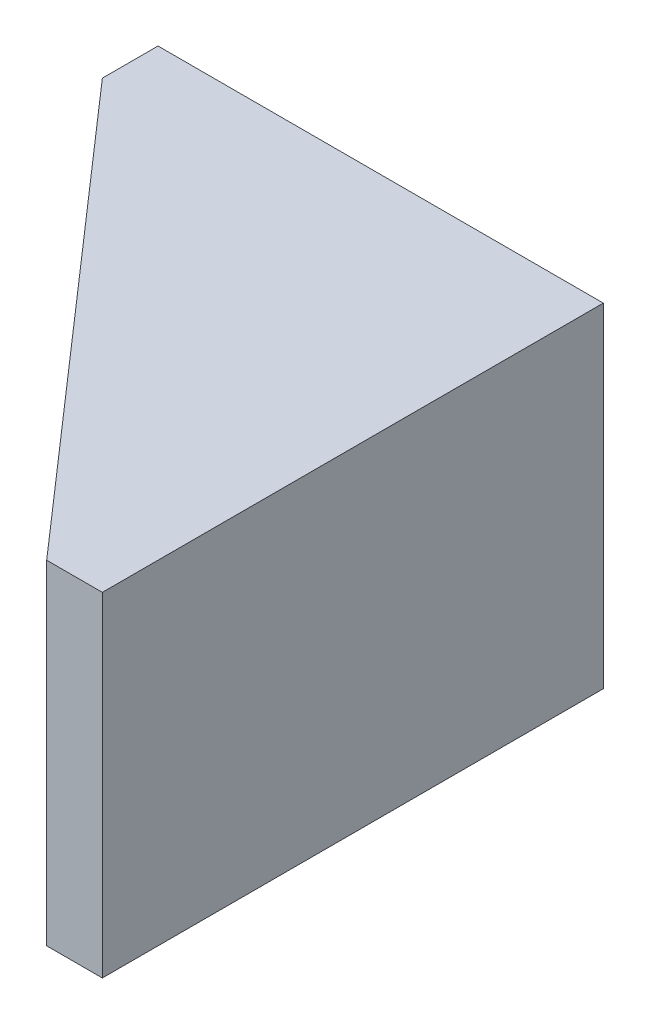
ISO-10303-21;
HEADER;
FILE_DESCRIPTION(('STEP AP214'),'2;1');
FILE_NAME('part.step','',(''),(''),'','','');
FILE_SCHEMA(('AUTOMOTIVE_DESIGN { 1 0 10303 214 1 1 1 1 }'));
ENDSEC;
DATA;
#1=APPLICATION_CONTEXT('core data for automotive mechanical design processes');
#2=APPLICATION_PROTOCOL_DEFINITION('international standard','automotive_design',2000,#1);
#3=PRODUCT_CONTEXT('',#1,'mechanical');
#4=PRODUCT('Part','Part','',(#3));
#5=PRODUCT_RELATED_PRODUCT_CATEGORY('part','',(#4));
#6=PRODUCT_DEFINITION_FORMATION('','',#4);
#7=PRODUCT_DEFINITION_CONTEXT('part definition',#1,'design');
#8=PRODUCT_DEFINITION('design','',#6,#7);
#9=PRODUCT_DEFINITION_SHAPE('','',#8);
#10=(LENGTH_UNIT() NAMED_UNIT(*) SI_UNIT(.MILLI.,.METRE.));
#11=(NAMED_UNIT(*) PLANE_ANGLE_UNIT() SI_UNIT($,.RADIAN.));
#12=(NAMED_UNIT(*) SI_UNIT($,.STERADIAN.) SOLID_ANGLE_UNIT());
#13=UNCERTAINTY_MEASURE_WITH_UNIT(LENGTH_MEASURE(1.E-05),#10,'distance_accuracy_value','');
#14=(GEOMETRIC_REPRESENTATION_CONTEXT(3) GLOBAL_UNCERTAINTY_ASSIGNED_CONTEXT((#13)) GLOBAL_UNIT_ASSIGNED_CONTEXT((#10,
#11,#12)) REPRESENTATION_CONTEXT('',''));
#15=CARTESIAN_POINT('',(0.,0.,0.));
#16=DIRECTION('',(0.,0.,1.));
#17=DIRECTION('',(1.,0.,0.));
#18=AXIS2_PLACEMENT_3D('',#15,#16,#17);
#19=CARTESIAN_POINT('',(0.,0.,3.175));
#20=DIRECTION('',(0.,0.,1.));
#21=DIRECTION('',(1.,0.,0.));
#22=AXIS2_PLACEMENT_3D('',#19,#20,#21);
#23=PLANE('',#22);
#24=CARTESIAN_POINT('',(-9.525,0.,3.175));
#25=DIRECTION('',(0.,0.,1.));
#26=DIRECTION('',(1.,0.,0.));
#27=AXIS2_PLACEMENT_3D('',#24,#25,#26);
#28=CIRCLE('',#27,2.);
#29=CARTESIAN_POINT('',(-7.525,0.,3.175));
#30=VERTEX_POINT('',#29);
#31=EDGE_CURVE('E144',#30,#30,#28,.T.);
#32=ORIENTED_EDGE('',*,*,#31,.F.);
#33=EDGE_LOOP('',(#32));
#34=FACE_BOUND('',#33,.T.);
#35=CARTESIAN_POINT('',(-19.05,0.,3.175));
#36=DIRECTION('',(0.,0.,1.));
#37=DIRECTION('',(1.,0.,0.));
#38=AXIS2_PLACEMENT_3D('',#35,#36,#37);
#39=CIRCLE('',#38,2.);
#40=CARTESIAN_POINT('',(-17.05,0.,3.175));
#41=VERTEX_POINT('',#40);
#42=EDGE_CURVE('E188',#41,#41,#39,.T.);
#43=ORIENTED_EDGE('',*,*,#42,.F.);
#44=EDGE_LOOP('',(#43));
#45=FACE_BOUND('',#44,.T.);
#46=DIRECTION('',(0.,-1.,0.));
#47=VECTOR('',#46,1.);
#48=CARTESIAN_POINT('',(-25.4,9.52499999999998,3.175));
#49=LINE('',#48,#47);
#50=CARTESIAN_POINT('',(-25.4,6.34999999999999,3.175));
#51=VERTEX_POINT('',#50);
#52=CARTESIAN_POINT('',(-25.4,-6.34999999999999,3.175));
#53=VERTEX_POINT('',#52);
#54=EDGE_CURVE('E128',#51,#53,#49,.T.);
#55=ORIENTED_EDGE('',*,*,#54,.T.);
#56=DIRECTION('',(1.,0.,0.));
#57=VECTOR('',#56,1.);
#58=CARTESIAN_POINT('',(0.,-6.35,3.175));
#59=LINE('',#58,#57);
#60=CARTESIAN_POINT('',(-3.175,-6.35,3.175));
#61=VERTEX_POINT('',#60);
#62=EDGE_CURVE('E104',#53,#61,#59,.T.);
#63=ORIENTED_EDGE('',*,*,#62,.T.);
#64=DIRECTION('',(0.,-1.,0.));
#65=VECTOR('',#64,1.);
#66=CARTESIAN_POINT('',(-3.175,9.525,3.175));
#67=LINE('',#66,#65);
#68=CARTESIAN_POINT('',(-3.175,6.35,3.175));
#69=VERTEX_POINT('',#68);
#70=EDGE_CURVE('E180',#69,#61,#67,.T.);
#71=ORIENTED_EDGE('',*,*,#70,.F.);
#72=DIRECTION('',(-1.,0.,0.));
#73=VECTOR('',#72,1.);
#74=CARTESIAN_POINT('',(0.,6.35,3.175));
#75=LINE('',#74,#73);
#76=EDGE_CURVE('E131',#69,#51,#75,.T.);
#77=ORIENTED_EDGE('',*,*,#76,.T.);
#78=EDGE_LOOP('',(#55,#63,#71,#77));
#79=FACE_BOUND('',#78,.T.);
#80=ADVANCED_FACE('F37',(#34,#45,#79),#23,.T.);
#81=CARTESIAN_POINT('',(-3.175,9.525,28.575));
#82=DIRECTION('',(1.,0.,0.));
#83=DIRECTION('',(0.,1.,0.));
#84=AXIS2_PLACEMENT_3D('',#81,#82,#83);
#85=PLANE('',#84);
#86=DIRECTION('',(0.,0.,-1.));
#87=VECTOR('',#86,1.);
#88=CARTESIAN_POINT('',(-3.175,-6.35,28.575));
#89=LINE('',#88,#87);
#90=CARTESIAN_POINT('',(-3.17499999999999,-6.35,28.575));
#91=VERTEX_POINT('',#90);
#92=EDGE_CURVE('E109',#91,#61,#89,.T.);
#93=ORIENTED_EDGE('',*,*,#92,.F.);
#94=DIRECTION('',(0.,-1.,0.));
#95=VECTOR('',#94,1.);
#96=CARTESIAN_POINT('',(-3.175,9.525,28.575));
#97=LINE('',#96,#95);
#98=CARTESIAN_POINT('',(-3.175,6.35,28.575));
#99=VERTEX_POINT('',#98);
#100=EDGE_CURVE('E178',#99,#91,#97,.T.);
#101=ORIENTED_EDGE('',*,*,#100,.F.);
#102=DIRECTION('',(0.,0.,1.));
#103=VECTOR('',#102,1.);
#104=CARTESIAN_POINT('',(-3.175,6.35,28.575));
#105=LINE('',#104,#103);
#106=EDGE_CURVE('E170',#69,#99,#105,.T.);
#107=ORIENTED_EDGE('',*,*,#106,.F.);
#108=ORIENTED_EDGE('',*,*,#70,.T.);
#109=EDGE_LOOP('',(#93,#101,#107,#108));
#110=FACE_BOUND('',#109,.T.);
#111=ADVANCED_FACE('F212',(#110),#85,.F.);
#112=CARTESIAN_POINT('',(0.,0.,0.));
#113=DIRECTION('',(0.,0.,1.));
#114=DIRECTION('',(1.,0.,0.));
#115=AXIS2_PLACEMENT_3D('',#112,#113,#114);
#116=PLANE('',#115);
#117=DIRECTION('',(1.,0.,0.));
#118=VECTOR('',#117,1.);
#119=CARTESIAN_POINT('',(-25.4,-9.525,0.));
#120=LINE('',#119,#118);
#121=CARTESIAN_POINT('',(-25.4,-9.525,0.));
#122=VERTEX_POINT('',#121);
#123=CARTESIAN_POINT('',(0.,-9.525,0.));
#124=VERTEX_POINT('',#123);
#125=EDGE_CURVE('E143',#122,#124,#120,.T.);
#126=ORIENTED_EDGE('',*,*,#125,.F.);
#127=DIRECTION('',(0.,-1.,0.));
#128=VECTOR('',#127,1.);
#129=CARTESIAN_POINT('',(-25.4,9.52499999999998,0.));
#130=LINE('',#129,#128);
#131=CARTESIAN_POINT('',(-25.4,9.52499999999998,0.));
#132=VERTEX_POINT('',#131);
#133=EDGE_CURVE('E141',#132,#122,#130,.T.);
#134=ORIENTED_EDGE('',*,*,#133,.F.);
#135=DIRECTION('',(-1.,0.,0.));
#136=VECTOR('',#135,1.);
#137=CARTESIAN_POINT('',(-25.4,9.52499999999998,0.));
#138=LINE('',#137,#136);
#139=CARTESIAN_POINT('',(0.,9.525,0.));
#140=VERTEX_POINT('',#139);
#141=EDGE_CURVE('E60',#140,#132,#138,.T.);
#142=ORIENTED_EDGE('',*,*,#141,.F.);
#143=DIRECTION('',(0.,1.,0.));
#144=VECTOR('',#143,1.);
#145=CARTESIAN_POINT('',(0.,9.525,0.));
#146=LINE('',#145,#144);
#147=EDGE_CURVE('E135',#124,#140,#146,.T.);
#148=ORIENTED_EDGE('',*,*,#147,.F.);
#149=EDGE_LOOP('',(#126,#134,#142,#148));
#150=FACE_BOUND('',#149,.T.);
#151=CARTESIAN_POINT('',(-9.525,0.,0.));
#152=DIRECTION('',(0.,0.,1.));
#153=DIRECTION('',(1.,0.,0.));
#154=AXIS2_PLACEMENT_3D('',#151,#152,#153);
#155=CIRCLE('',#154,2.);
#156=CARTESIAN_POINT('',(-7.525,0.,0.));
#157=VERTEX_POINT('',#156);
#158=EDGE_CURVE('E139',#157,#157,#155,.T.);
#159=ORIENTED_EDGE('',*,*,#158,.T.);
#160=EDGE_LOOP('',(#159));
#161=FACE_BOUND('',#160,.T.);
#162=CARTESIAN_POINT('',(-19.05,0.,0.));
#163=DIRECTION('',(0.,0.,1.));
#164=DIRECTION('',(1.,0.,0.));
#165=AXIS2_PLACEMENT_3D('',#162,#163,#164);
#166=CIRCLE('',#165,2.);
#167=CARTESIAN_POINT('',(-17.05,0.,0.));
#168=VERTEX_POINT('',#167);
#169=EDGE_CURVE('E186',#168,#168,#166,.T.);
#170=ORIENTED_EDGE('',*,*,#169,.T.);
#171=EDGE_LOOP('',(#170));
#172=FACE_BOUND('',#171,.T.);
#173=ADVANCED_FACE('F161',(#150,#161,#172),#116,.F.);
#174=CARTESIAN_POINT('',(-25.4,9.52499999999998,3.175));
#175=DIRECTION('',(1.,0.,0.));
#176=DIRECTION('',(0.,1.,0.));
#177=AXIS2_PLACEMENT_3D('',#174,#175,#176);
#178=PLANE('',#177);
#179=DIRECTION('',(0.,1.,0.));
#180=VECTOR('',#179,1.);
#181=CARTESIAN_POINT('',(-25.4,9.52499999999998,3.17499999999999));
#182=LINE('',#181,#180);
#183=CARTESIAN_POINT('',(-25.4,-9.52499999999998,3.17500000000001));
#184=VERTEX_POINT('',#183);
#185=EDGE_CURVE('E114',#53,#184,#182,.F.);
#186=ORIENTED_EDGE('',*,*,#185,.F.);
#187=ORIENTED_EDGE('',*,*,#54,.F.);
#188=CARTESIAN_POINT('',(-25.4,9.52499999999998,3.175));
#189=VERTEX_POINT('',#188);
#190=EDGE_CURVE('E132',#189,#51,#49,.T.);
#191=ORIENTED_EDGE('',*,*,#190,.F.);
#192=DIRECTION('',(0.,0.,-1.));
#193=VECTOR('',#192,1.);
#194=CARTESIAN_POINT('',(-25.4,9.52499999999998,3.175));
#195=LINE('',#194,#193);
#196=EDGE_CURVE('E134',#189,#132,#195,.T.);
#197=ORIENTED_EDGE('',*,*,#196,.T.);
#198=ORIENTED_EDGE('',*,*,#133,.T.);
#199=DIRECTION('',(0.,0.,-1.));
#200=VECTOR('',#199,1.);
#201=CARTESIAN_POINT('',(-25.4,-9.525,3.175));
#202=LINE('',#201,#200);
#203=EDGE_CURVE('E11',#184,#122,#202,.T.);
#204=ORIENTED_EDGE('',*,*,#203,.F.);
#205=EDGE_LOOP('',(#186,#187,#191,#197,#198,#204));
#206=FACE_BOUND('',#205,.T.);
#207=ADVANCED_FACE('F39',(#206),#178,.F.);
#208=CARTESIAN_POINT('',(-25.4,-9.525,3.175));
#209=DIRECTION('',(0.,1.,0.));
#210=DIRECTION('',(-1.,0.,0.));
#211=AXIS2_PLACEMENT_3D('',#208,#209,#210);
#212=PLANE('',#211);
#213=ORIENTED_EDGE('',*,*,#125,.T.);
#214=DIRECTION('',(0.,0.,-1.));
#215=VECTOR('',#214,1.);
#216=CARTESIAN_POINT('',(0.,-9.525,3.175));
#217=LINE('',#216,#215);
#218=CARTESIAN_POINT('',(0.,-9.525,28.575));
#219=VERTEX_POINT('',#218);
#220=EDGE_CURVE('E45',#219,#124,#217,.T.);
#221=ORIENTED_EDGE('',*,*,#220,.F.);
#222=DIRECTION('',(1.,0.,0.));
#223=VECTOR('',#222,1.);
#224=CARTESIAN_POINT('',(0.,-9.525,28.575));
#225=LINE('',#224,#223);
#226=CARTESIAN_POINT('',(-3.175,-9.525,28.575));
#227=VERTEX_POINT('',#226);
#228=EDGE_CURVE('E184',#227,#219,#225,.T.);
#229=ORIENTED_EDGE('',*,*,#228,.F.);
#230=DIRECTION('',(0.658504607868518,0.,0.752576694706878));
#231=VECTOR('',#230,1.);
#232=CARTESIAN_POINT('',(-25.4,-9.52499999999998,3.175));
#233=LINE('',#232,#231);
#234=EDGE_CURVE('E122',#184,#227,#233,.T.);
#235=ORIENTED_EDGE('',*,*,#234,.F.);
#236=ORIENTED_EDGE('',*,*,#203,.T.);
#237=EDGE_LOOP('',(#213,#221,#229,#235,#236));
#238=FACE_BOUND('',#237,.T.);
#239=ADVANCED_FACE('F224',(#238),#212,.F.);
#240=CARTESIAN_POINT('',(0.,9.525,3.175));
#241=DIRECTION('',(-1.,0.,0.));
#242=DIRECTION('',(0.,-1.,0.));
#243=AXIS2_PLACEMENT_3D('',#240,#241,#242);
#244=PLANE('',#243);
#245=ORIENTED_EDGE('',*,*,#147,.T.);
#246=DIRECTION('',(0.,0.,-1.));
#247=VECTOR('',#246,1.);
#248=CARTESIAN_POINT('',(0.,9.525,3.175));
#249=LINE('',#248,#247);
#250=CARTESIAN_POINT('',(0.,9.525,28.575));
#251=VERTEX_POINT('',#250);
#252=EDGE_CURVE('E148',#251,#140,#249,.T.);
#253=ORIENTED_EDGE('',*,*,#252,.F.);
#254=DIRECTION('',(0.,1.,0.));
#255=VECTOR('',#254,1.);
#256=CARTESIAN_POINT('',(0.,9.525,28.575));
#257=LINE('',#256,#255);
#258=EDGE_CURVE('E155',#219,#251,#257,.T.);
#259=ORIENTED_EDGE('',*,*,#258,.F.);
#260=ORIENTED_EDGE('',*,*,#220,.T.);
#261=EDGE_LOOP('',(#245,#253,#259,#260));
#262=FACE_BOUND('',#261,.T.);
#263=ADVANCED_FACE('F153',(#262),#244,.F.);
#264=CARTESIAN_POINT('',(-25.4,9.52499999999998,3.175));
#265=DIRECTION('',(0.,-1.,0.));
#266=DIRECTION('',(1.,0.,0.));
#267=AXIS2_PLACEMENT_3D('',#264,#265,#266);
#268=PLANE('',#267);
#269=ORIENTED_EDGE('',*,*,#196,.F.);
#270=DIRECTION('',(0.658504607868518,0.,0.752576694706878));
#271=VECTOR('',#270,1.);
#272=CARTESIAN_POINT('',(-25.4,9.52499999999998,3.175));
#273=LINE('',#272,#271);
#274=CARTESIAN_POINT('',(-3.175,9.525,28.575));
#275=VERTEX_POINT('',#274);
#276=EDGE_CURVE('E167',#189,#275,#273,.T.);
#277=ORIENTED_EDGE('',*,*,#276,.T.);
#278=DIRECTION('',(-1.,0.,0.));
#279=VECTOR('',#278,1.);
#280=CARTESIAN_POINT('',(0.,9.525,28.575));
#281=LINE('',#280,#279);
#282=EDGE_CURVE('E169',#251,#275,#281,.T.);
#283=ORIENTED_EDGE('',*,*,#282,.F.);
#284=ORIENTED_EDGE('',*,*,#252,.T.);
#285=ORIENTED_EDGE('',*,*,#141,.T.);
#286=EDGE_LOOP('',(#269,#277,#283,#284,#285));
#287=FACE_BOUND('',#286,.T.);
#288=ADVANCED_FACE('F165',(#287),#268,.F.);
#289=CARTESIAN_POINT('',(-9.525,0.,3.175));
#290=DIRECTION('',(0.,0.,-1.));
#291=DIRECTION('',(-1.,0.,0.));
#292=AXIS2_PLACEMENT_3D('',#289,#290,#291);
#293=CYLINDRICAL_SURFACE('',#292,2.);
#294=ORIENTED_EDGE('',*,*,#31,.T.);
#295=EDGE_LOOP('',(#294));
#296=FACE_BOUND('',#295,.T.);
#297=ORIENTED_EDGE('',*,*,#158,.F.);
#298=EDGE_LOOP('',(#297));
#299=FACE_BOUND('',#298,.T.);
#300=ADVANCED_FACE('F199',(#296,#299),#293,.F.);
#301=CARTESIAN_POINT('',(-19.05,0.,3.175));
#302=DIRECTION('',(0.,0.,-1.));
#303=DIRECTION('',(-1.,0.,0.));
#304=AXIS2_PLACEMENT_3D('',#301,#302,#303);
#305=CYLINDRICAL_SURFACE('',#304,2.);
#306=ORIENTED_EDGE('',*,*,#42,.T.);
#307=EDGE_LOOP('',(#306));
#308=FACE_BOUND('',#307,.T.);
#309=ORIENTED_EDGE('',*,*,#169,.F.);
#310=EDGE_LOOP('',(#309));
#311=FACE_BOUND('',#310,.T.);
#312=ADVANCED_FACE('F201',(#308,#311),#305,.F.);
#313=CARTESIAN_POINT('',(0.,0.,28.575));
#314=DIRECTION('',(0.,0.,-1.));
#315=DIRECTION('',(-1.,0.,0.));
#316=AXIS2_PLACEMENT_3D('',#313,#314,#315);
#317=PLANE('',#316);
#318=ORIENTED_EDGE('',*,*,#258,.T.);
#319=ORIENTED_EDGE('',*,*,#282,.T.);
#320=EDGE_CURVE('E176',#275,#99,#97,.T.);
#321=ORIENTED_EDGE('',*,*,#320,.T.);
#322=ORIENTED_EDGE('',*,*,#100,.T.);
#323=EDGE_CURVE('E121',#91,#227,#97,.T.);
#324=ORIENTED_EDGE('',*,*,#323,.T.);
#325=ORIENTED_EDGE('',*,*,#228,.T.);
#326=EDGE_LOOP('',(#318,#319,#321,#322,#324,#325));
#327=FACE_BOUND('',#326,.T.);
#328=ADVANCED_FACE('F174',(#327),#317,.F.);
#329=CARTESIAN_POINT('',(-25.4,9.52499999999998,3.175));
#330=DIRECTION('',(-0.752576694706878,0.,0.658504607868518));
#331=DIRECTION('',(0.658504607868518,0.,0.752576694706878));
#332=AXIS2_PLACEMENT_3D('',#329,#330,#331);
#333=PLANE('',#332);
#334=ORIENTED_EDGE('',*,*,#276,.F.);
#335=ORIENTED_EDGE('',*,*,#190,.T.);
#336=DIRECTION('',(0.658504607868518,0.,0.752576694706878));
#337=VECTOR('',#336,1.);
#338=CARTESIAN_POINT('',(-25.4,6.34999999999999,3.175));
#339=LINE('',#338,#337);
#340=EDGE_CURVE('E52',#51,#99,#339,.T.);
#341=ORIENTED_EDGE('',*,*,#340,.T.);
#342=ORIENTED_EDGE('',*,*,#320,.F.);
#343=EDGE_LOOP('',(#334,#335,#341,#342));
#344=FACE_BOUND('',#343,.T.);
#345=ADVANCED_FACE('F238',(#344),#333,.T.);
#346=CARTESIAN_POINT('',(-12.7,6.34999999999999,14.2875));
#347=DIRECTION('',(0.,1.,0.));
#348=DIRECTION('',(-1.,0.,0.));
#349=AXIS2_PLACEMENT_3D('',#346,#347,#348);
#350=PLANE('',#349);
#351=ORIENTED_EDGE('',*,*,#76,.F.);
#352=ORIENTED_EDGE('',*,*,#106,.T.);
#353=ORIENTED_EDGE('',*,*,#340,.F.);
#354=EDGE_LOOP('',(#351,#352,#353));
#355=FACE_BOUND('',#354,.T.);
#356=ADVANCED_FACE('F236',(#355),#350,.F.);
#357=CARTESIAN_POINT('',(-25.4,-9.52499999999998,3.175));
#358=DIRECTION('',(0.752576694706878,0.,-0.658504607868518));
#359=DIRECTION('',(0.658504607868518,0.,0.752576694706878));
#360=AXIS2_PLACEMENT_3D('',#357,#358,#359);
#361=PLANE('',#360);
#362=DIRECTION('',(0.658504607868518,0.,0.752576694706878));
#363=VECTOR('',#362,1.);
#364=CARTESIAN_POINT('',(-25.4,-6.34999999999999,3.175));
#365=LINE('',#364,#363);
#366=EDGE_CURVE('E107',#53,#91,#365,.T.);
#367=ORIENTED_EDGE('',*,*,#366,.F.);
#368=ORIENTED_EDGE('',*,*,#185,.T.);
#369=ORIENTED_EDGE('',*,*,#234,.T.);
#370=ORIENTED_EDGE('',*,*,#323,.F.);
#371=EDGE_LOOP('',(#367,#368,#369,#370));
#372=FACE_BOUND('',#371,.T.);
#373=ADVANCED_FACE('F118',(#372),#361,.F.);
#374=CARTESIAN_POINT('',(-12.7,-6.34999999999999,14.2875));
#375=DIRECTION('',(0.,-1.,0.));
#376=DIRECTION('',(1.,0.,0.));
#377=AXIS2_PLACEMENT_3D('',#374,#375,#376);
#378=PLANE('',#377);
#379=ORIENTED_EDGE('',*,*,#62,.F.);
#380=ORIENTED_EDGE('',*,*,#366,.T.);
#381=ORIENTED_EDGE('',*,*,#92,.T.);
#382=EDGE_LOOP('',(#379,#380,#381));
#383=FACE_BOUND('',#382,.T.);
#384=ADVANCED_FACE('F106',(#383),#378,.F.);
#385=CLOSED_SHELL('',(#80,#111,#173,#207,#239,#263,#288,#300,#312,#328,#345,#356,#373,#384));
#386=MANIFOLD_SOLID_BREP('B2',#385);
#387=ADVANCED_BREP_SHAPE_REPRESENTATION('',(#18,#386),#14);
#388=SHAPE_DEFINITION_REPRESENTATION(#9,#387);
ENDSEC;
END-ISO-10303-21;
